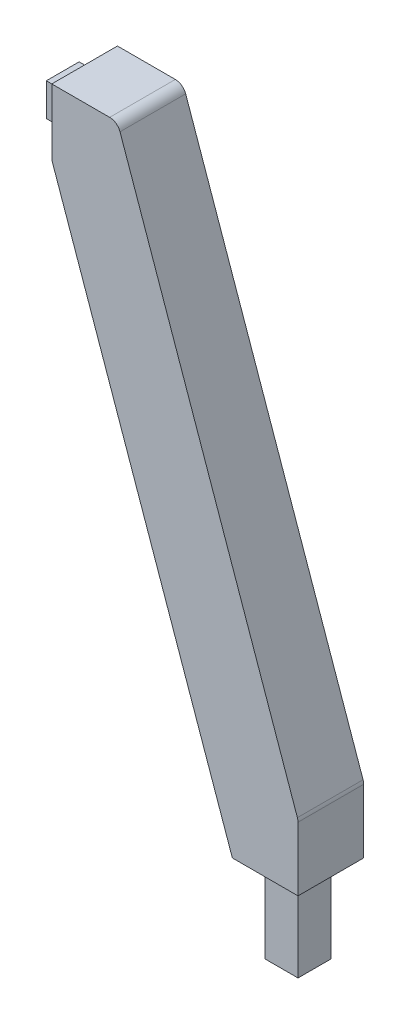
ISO-10303-21;
HEADER;
FILE_DESCRIPTION(('STEP AP214'),'2;1');
FILE_NAME('part.step','',(''),(''),'','','');
FILE_SCHEMA(('AUTOMOTIVE_DESIGN { 1 0 10303 214 1 1 1 1 }'));
ENDSEC;
DATA;
#1=APPLICATION_CONTEXT('core data for automotive mechanical design processes');
#2=APPLICATION_PROTOCOL_DEFINITION('international standard','automotive_design',2000,#1);
#3=PRODUCT_CONTEXT('',#1,'mechanical');
#4=PRODUCT('Part','Part','',(#3));
#5=PRODUCT_RELATED_PRODUCT_CATEGORY('part','',(#4));
#6=PRODUCT_DEFINITION_FORMATION('','',#4);
#7=PRODUCT_DEFINITION_CONTEXT('part definition',#1,'design');
#8=PRODUCT_DEFINITION('design','',#6,#7);
#9=PRODUCT_DEFINITION_SHAPE('','',#8);
#10=(LENGTH_UNIT() NAMED_UNIT(*) SI_UNIT(.MILLI.,.METRE.));
#11=(NAMED_UNIT(*) PLANE_ANGLE_UNIT() SI_UNIT($,.RADIAN.));
#12=(NAMED_UNIT(*) SI_UNIT($,.STERADIAN.) SOLID_ANGLE_UNIT());
#13=UNCERTAINTY_MEASURE_WITH_UNIT(LENGTH_MEASURE(1.E-05),#10,'distance_accuracy_value','');
#14=(GEOMETRIC_REPRESENTATION_CONTEXT(3) GLOBAL_UNCERTAINTY_ASSIGNED_CONTEXT((#13)) GLOBAL_UNIT_ASSIGNED_CONTEXT((#10,
#11,#12)) REPRESENTATION_CONTEXT('',''));
#15=CARTESIAN_POINT('',(0.,0.,0.));
#16=DIRECTION('',(0.,0.,1.));
#17=DIRECTION('',(1.,0.,0.));
#18=AXIS2_PLACEMENT_3D('',#15,#16,#17);
#19=CARTESIAN_POINT('',(0.,0.,30.));
#20=DIRECTION('',(0.,1.,0.));
#21=DIRECTION('',(-1.,0.,0.));
#22=AXIS2_PLACEMENT_3D('',#19,#20,#21);
#23=PLANE('',#22);
#24=DIRECTION('',(1.,0.,0.));
#25=VECTOR('',#24,1.);
#26=CARTESIAN_POINT('',(0.,0.,0.));
#27=LINE('',#26,#25);
#28=CARTESIAN_POINT('',(-30.,0.,0.));
#29=VERTEX_POINT('',#28);
#30=CARTESIAN_POINT('',(0.,0.,0.));
#31=VERTEX_POINT('',#30);
#32=EDGE_CURVE('E222',#29,#31,#27,.T.);
#33=ORIENTED_EDGE('',*,*,#32,.T.);
#34=DIRECTION('',(0.,0.,-1.));
#35=VECTOR('',#34,1.);
#36=CARTESIAN_POINT('',(0.,0.,30.));
#37=LINE('',#36,#35);
#38=CARTESIAN_POINT('',(0.,0.,30.));
#39=VERTEX_POINT('',#38);
#40=EDGE_CURVE('E232',#39,#31,#37,.T.);
#41=ORIENTED_EDGE('',*,*,#40,.F.);
#42=DIRECTION('',(1.,0.,0.));
#43=VECTOR('',#42,1.);
#44=CARTESIAN_POINT('',(0.,0.,30.));
#45=LINE('',#44,#43);
#46=CARTESIAN_POINT('',(-30.,0.,30.));
#47=VERTEX_POINT('',#46);
#48=EDGE_CURVE('E230',#47,#39,#45,.T.);
#49=ORIENTED_EDGE('',*,*,#48,.F.);
#50=DIRECTION('',(0.,0.,-1.));
#51=VECTOR('',#50,1.);
#52=CARTESIAN_POINT('',(-30.,0.,30.));
#53=LINE('',#52,#51);
#54=EDGE_CURVE('E246',#47,#29,#53,.T.);
#55=ORIENTED_EDGE('',*,*,#54,.T.);
#56=EDGE_LOOP('',(#33,#41,#49,#55));
#57=FACE_BOUND('',#56,.T.);
#58=DIRECTION('',(0.,0.,-1.));
#59=VECTOR('',#58,1.);
#60=CARTESIAN_POINT('',(-22.49,0.,22.49));
#61=LINE('',#60,#59);
#62=CARTESIAN_POINT('',(-22.49,0.,22.49));
#63=VERTEX_POINT('',#62);
#64=CARTESIAN_POINT('',(-22.49,0.,7.51));
#65=VERTEX_POINT('',#64);
#66=EDGE_CURVE('E179',#63,#65,#61,.T.);
#67=ORIENTED_EDGE('',*,*,#66,.F.);
#68=DIRECTION('',(-1.,0.,0.));
#69=VECTOR('',#68,1.);
#70=CARTESIAN_POINT('',(-22.49,0.,22.49));
#71=LINE('',#70,#69);
#72=CARTESIAN_POINT('',(-7.51,0.,22.49));
#73=VERTEX_POINT('',#72);
#74=EDGE_CURVE('E176',#73,#63,#71,.T.);
#75=ORIENTED_EDGE('',*,*,#74,.F.);
#76=DIRECTION('',(0.,0.,1.));
#77=VECTOR('',#76,1.);
#78=CARTESIAN_POINT('',(-7.51,0.,22.49));
#79=LINE('',#78,#77);
#80=CARTESIAN_POINT('',(-7.51,0.,7.51));
#81=VERTEX_POINT('',#80);
#82=EDGE_CURVE('E478',#81,#73,#79,.T.);
#83=ORIENTED_EDGE('',*,*,#82,.F.);
#84=DIRECTION('',(1.,0.,0.));
#85=VECTOR('',#84,1.);
#86=CARTESIAN_POINT('',(-22.49,0.,7.51));
#87=LINE('',#86,#85);
#88=EDGE_CURVE('E484',#65,#81,#87,.T.);
#89=ORIENTED_EDGE('',*,*,#88,.F.);
#90=EDGE_LOOP('',(#67,#75,#83,#89));
#91=FACE_BOUND('',#90,.T.);
#92=ADVANCED_FACE('F39',(#57,#91),#23,.F.);
#93=CARTESIAN_POINT('',(-112.5,235.,30.));
#94=DIRECTION('',(1.,0.,0.));
#95=DIRECTION('',(0.,0.,-1.));
#96=AXIS2_PLACEMENT_3D('',#93,#94,#95);
#97=PLANE('',#96);
#98=DIRECTION('',(0.,-1.,0.));
#99=VECTOR('',#98,1.);
#100=CARTESIAN_POINT('',(-112.5,235.,0.));
#101=LINE('',#100,#99);
#102=CARTESIAN_POINT('',(-112.5,265.,0.));
#103=VERTEX_POINT('',#102);
#104=CARTESIAN_POINT('',(-112.5,235.,0.));
#105=VERTEX_POINT('',#104);
#106=EDGE_CURVE('E239',#103,#105,#101,.T.);
#107=ORIENTED_EDGE('',*,*,#106,.T.);
#108=DIRECTION('',(0.,0.,-1.));
#109=VECTOR('',#108,1.);
#110=CARTESIAN_POINT('',(-112.5,235.,30.));
#111=LINE('',#110,#109);
#112=CARTESIAN_POINT('',(-112.5,235.,30.));
#113=VERTEX_POINT('',#112);
#114=EDGE_CURVE('E249',#113,#105,#111,.T.);
#115=ORIENTED_EDGE('',*,*,#114,.F.);
#116=DIRECTION('',(0.,-1.,0.));
#117=VECTOR('',#116,1.);
#118=CARTESIAN_POINT('',(-112.5,235.,30.));
#119=LINE('',#118,#117);
#120=CARTESIAN_POINT('',(-112.5,265.,30.));
#121=VERTEX_POINT('',#120);
#122=EDGE_CURVE('E226',#121,#113,#119,.T.);
#123=ORIENTED_EDGE('',*,*,#122,.F.);
#124=DIRECTION('',(0.,0.,-1.));
#125=VECTOR('',#124,1.);
#126=CARTESIAN_POINT('',(-112.5,265.,30.));
#127=LINE('',#126,#125);
#128=EDGE_CURVE('E252',#121,#103,#127,.T.);
#129=ORIENTED_EDGE('',*,*,#128,.T.);
#130=EDGE_LOOP('',(#107,#115,#123,#129));
#131=FACE_BOUND('',#130,.T.);
#132=DIRECTION('',(0.,-1.,0.));
#133=VECTOR('',#132,1.);
#134=CARTESIAN_POINT('',(-112.5,257.49,7.51));
#135=LINE('',#134,#133);
#136=CARTESIAN_POINT('',(-112.5,257.49,7.51));
#137=VERTEX_POINT('',#136);
#138=CARTESIAN_POINT('',(-112.5,242.51,7.51));
#139=VERTEX_POINT('',#138);
#140=EDGE_CURVE('E180',#137,#139,#135,.T.);
#141=ORIENTED_EDGE('',*,*,#140,.F.);
#142=DIRECTION('',(0.,0.,-1.));
#143=VECTOR('',#142,1.);
#144=CARTESIAN_POINT('',(-112.5,257.49,7.51));
#145=LINE('',#144,#143);
#146=CARTESIAN_POINT('',(-112.5,257.49,22.49));
#147=VERTEX_POINT('',#146);
#148=EDGE_CURVE('E193',#147,#137,#145,.T.);
#149=ORIENTED_EDGE('',*,*,#148,.F.);
#150=DIRECTION('',(0.,1.,0.));
#151=VECTOR('',#150,1.);
#152=CARTESIAN_POINT('',(-112.5,257.49,22.49));
#153=LINE('',#152,#151);
#154=CARTESIAN_POINT('',(-112.5,242.51,22.49));
#155=VERTEX_POINT('',#154);
#156=EDGE_CURVE('E202',#155,#147,#153,.T.);
#157=ORIENTED_EDGE('',*,*,#156,.F.);
#158=DIRECTION('',(0.,0.,1.));
#159=VECTOR('',#158,1.);
#160=CARTESIAN_POINT('',(-112.5,242.51,7.51));
#161=LINE('',#160,#159);
#162=EDGE_CURVE('E183',#139,#155,#161,.T.);
#163=ORIENTED_EDGE('',*,*,#162,.F.);
#164=EDGE_LOOP('',(#141,#149,#157,#163));
#165=FACE_BOUND('',#164,.T.);
#166=ADVANCED_FACE('F294',(#131,#165),#97,.F.);
#167=CARTESIAN_POINT('',(0.,0.,30.));
#168=DIRECTION('',(-1.,0.,0.));
#169=DIRECTION('',(0.,0.,1.));
#170=AXIS2_PLACEMENT_3D('',#167,#168,#169);
#171=PLANE('',#170);
#172=DIRECTION('',(0.,1.,0.));
#173=VECTOR('',#172,1.);
#174=CARTESIAN_POINT('',(0.,0.,0.));
#175=LINE('',#174,#173);
#176=CARTESIAN_POINT('',(0.,29.1478342082036,0.));
#177=VERTEX_POINT('',#176);
#178=EDGE_CURVE('E218',#31,#177,#175,.T.);
#179=ORIENTED_EDGE('',*,*,#178,.T.);
#180=DIRECTION('',(0.,0.,-1.));
#181=VECTOR('',#180,1.);
#182=CARTESIAN_POINT('',(0.,29.1478342082036,30.));
#183=LINE('',#182,#181);
#184=CARTESIAN_POINT('',(0.,29.1478342082036,30.));
#185=VERTEX_POINT('',#184);
#186=EDGE_CURVE('E62',#177,#185,#183,.F.);
#187=ORIENTED_EDGE('',*,*,#186,.T.);
#188=DIRECTION('',(0.,1.,0.));
#189=VECTOR('',#188,1.);
#190=CARTESIAN_POINT('',(0.,0.,30.));
#191=LINE('',#190,#189);
#192=EDGE_CURVE('E219',#39,#185,#191,.T.);
#193=ORIENTED_EDGE('',*,*,#192,.F.);
#194=ORIENTED_EDGE('',*,*,#40,.T.);
#195=EDGE_LOOP('',(#179,#187,#193,#194));
#196=FACE_BOUND('',#195,.T.);
#197=ADVANCED_FACE('F279',(#196),#171,.F.);
#198=CARTESIAN_POINT('',(0.,30.,30.));
#199=DIRECTION('',(-0.943544952869572,-0.331244504730807,0.));
#200=DIRECTION('',(0.331244504730807,-0.943544952869572,0.));
#201=AXIS2_PLACEMENT_3D('',#198,#199,#200);
#202=PLANE('',#201);
#203=DIRECTION('',(-0.331244504730807,0.943544952869572,0.));
#204=VECTOR('',#203,1.);
#205=CARTESIAN_POINT('',(0.,30.,30.));
#206=LINE('',#205,#204);
#207=CARTESIAN_POINT('',(-0.282275235652141,30.8040567318576,30.));
#208=VERTEX_POINT('',#207);
#209=CARTESIAN_POINT('',(-81.3261206731977,261.656222523654,30.));
#210=VERTEX_POINT('',#209);
#211=EDGE_CURVE('E221',#208,#210,#206,.T.);
#212=ORIENTED_EDGE('',*,*,#211,.F.);
#213=DIRECTION('',(0.,0.,-1.));
#214=VECTOR('',#213,1.);
#215=CARTESIAN_POINT('',(-0.282275235652141,30.8040567318576,30.));
#216=LINE('',#215,#214);
#217=CARTESIAN_POINT('',(-0.282275235652141,30.8040567318576,0.));
#218=VERTEX_POINT('',#217);
#219=EDGE_CURVE('E257',#208,#218,#216,.T.);
#220=ORIENTED_EDGE('',*,*,#219,.T.);
#221=DIRECTION('',(-0.331244504730807,0.943544952869572,0.));
#222=VECTOR('',#221,1.);
#223=CARTESIAN_POINT('',(0.,30.,0.));
#224=LINE('',#223,#222);
#225=CARTESIAN_POINT('',(-81.3261206731977,261.656222523654,0.));
#226=VERTEX_POINT('',#225);
#227=EDGE_CURVE('E234',#218,#226,#224,.T.);
#228=ORIENTED_EDGE('',*,*,#227,.T.);
#229=DIRECTION('',(0.,0.,-1.));
#230=VECTOR('',#229,1.);
#231=CARTESIAN_POINT('',(-81.3261206731977,261.656222523654,30.));
#232=LINE('',#231,#230);
#233=EDGE_CURVE('E255',#226,#210,#232,.F.);
#234=ORIENTED_EDGE('',*,*,#233,.T.);
#235=EDGE_LOOP('',(#212,#220,#228,#234));
#236=FACE_BOUND('',#235,.T.);
#237=ADVANCED_FACE('F271',(#236),#202,.F.);
#238=CARTESIAN_POINT('',(-112.5,265.,30.));
#239=DIRECTION('',(0.,-1.,0.));
#240=DIRECTION('',(0.,0.,-1.));
#241=AXIS2_PLACEMENT_3D('',#238,#239,#240);
#242=PLANE('',#241);
#243=DIRECTION('',(-1.,0.,0.));
#244=VECTOR('',#243,1.);
#245=CARTESIAN_POINT('',(-112.5,265.,30.));
#246=LINE('',#245,#244);
#247=CARTESIAN_POINT('',(-86.0438454375455,265.,30.));
#248=VERTEX_POINT('',#247);
#249=EDGE_CURVE('E224',#248,#121,#246,.T.);
#250=ORIENTED_EDGE('',*,*,#249,.F.);
#251=DIRECTION('',(0.,0.,-1.));
#252=VECTOR('',#251,1.);
#253=CARTESIAN_POINT('',(-86.0438454375455,265.,30.));
#254=LINE('',#253,#252);
#255=CARTESIAN_POINT('',(-86.0438454375455,265.,0.));
#256=VERTEX_POINT('',#255);
#257=EDGE_CURVE('E11',#248,#256,#254,.T.);
#258=ORIENTED_EDGE('',*,*,#257,.T.);
#259=DIRECTION('',(-1.,0.,0.));
#260=VECTOR('',#259,1.);
#261=CARTESIAN_POINT('',(-112.5,265.,0.));
#262=LINE('',#261,#260);
#263=EDGE_CURVE('E237',#256,#103,#262,.T.);
#264=ORIENTED_EDGE('',*,*,#263,.T.);
#265=ORIENTED_EDGE('',*,*,#128,.F.);
#266=EDGE_LOOP('',(#250,#258,#264,#265));
#267=FACE_BOUND('',#266,.T.);
#268=ADVANCED_FACE('F298',(#267),#242,.F.);
#269=CARTESIAN_POINT('',(-112.5,235.,30.));
#270=DIRECTION('',(0.943544952869572,0.331244504730807,0.));
#271=DIRECTION('',(-0.331244504730807,0.943544952869572,0.));
#272=AXIS2_PLACEMENT_3D('',#269,#270,#271);
#273=PLANE('',#272);
#274=DIRECTION('',(0.331244504730807,-0.943544952869572,0.));
#275=VECTOR('',#274,1.);
#276=CARTESIAN_POINT('',(-112.5,235.,0.));
#277=LINE('',#276,#275);
#278=EDGE_CURVE('E241',#105,#29,#277,.T.);
#279=ORIENTED_EDGE('',*,*,#278,.T.);
#280=ORIENTED_EDGE('',*,*,#54,.F.);
#281=DIRECTION('',(0.331244504730807,-0.943544952869572,0.));
#282=VECTOR('',#281,1.);
#283=CARTESIAN_POINT('',(-112.5,235.,30.));
#284=LINE('',#283,#282);
#285=EDGE_CURVE('E228',#113,#47,#284,.T.);
#286=ORIENTED_EDGE('',*,*,#285,.F.);
#287=ORIENTED_EDGE('',*,*,#114,.T.);
#288=EDGE_LOOP('',(#279,#280,#286,#287));
#289=FACE_BOUND('',#288,.T.);
#290=ADVANCED_FACE('F289',(#289),#273,.F.);
#291=CARTESIAN_POINT('',(0.,0.,30.));
#292=DIRECTION('',(0.,0.,-1.));
#293=DIRECTION('',(-1.,0.,0.));
#294=AXIS2_PLACEMENT_3D('',#291,#292,#293);
#295=PLANE('',#294);
#296=ORIENTED_EDGE('',*,*,#192,.T.);
#297=CARTESIAN_POINT('',(-5.,29.1478342082036,30.));
#298=DIRECTION('',(0.,0.,-1.));
#299=DIRECTION('',(-1.,0.,0.));
#300=AXIS2_PLACEMENT_3D('',#297,#298,#299);
#301=CIRCLE('',#300,5.);
#302=EDGE_CURVE('E47',#185,#208,#301,.F.);
#303=ORIENTED_EDGE('',*,*,#302,.T.);
#304=ORIENTED_EDGE('',*,*,#211,.T.);
#305=CARTESIAN_POINT('',(-86.0438454375455,260.,30.));
#306=DIRECTION('',(0.,0.,-1.));
#307=DIRECTION('',(-1.,0.,0.));
#308=AXIS2_PLACEMENT_3D('',#305,#306,#307);
#309=CIRCLE('',#308,5.);
#310=EDGE_CURVE('E54',#210,#248,#309,.F.);
#311=ORIENTED_EDGE('',*,*,#310,.T.);
#312=ORIENTED_EDGE('',*,*,#249,.T.);
#313=ORIENTED_EDGE('',*,*,#122,.T.);
#314=ORIENTED_EDGE('',*,*,#285,.T.);
#315=ORIENTED_EDGE('',*,*,#48,.T.);
#316=EDGE_LOOP('',(#296,#303,#304,#311,#312,#313,#314,#315));
#317=FACE_BOUND('',#316,.T.);
#318=ADVANCED_FACE('F267',(#317),#295,.F.);
#319=CARTESIAN_POINT('',(0.,0.,0.));
#320=DIRECTION('',(0.,0.,-1.));
#321=DIRECTION('',(-1.,0.,0.));
#322=AXIS2_PLACEMENT_3D('',#319,#320,#321);
#323=PLANE('',#322);
#324=ORIENTED_EDGE('',*,*,#227,.F.);
#325=CARTESIAN_POINT('',(-5.,29.1478342082036,0.));
#326=DIRECTION('',(0.,0.,-1.));
#327=DIRECTION('',(-1.,0.,0.));
#328=AXIS2_PLACEMENT_3D('',#325,#326,#327);
#329=CIRCLE('',#328,5.);
#330=EDGE_CURVE('E262',#218,#177,#329,.T.);
#331=ORIENTED_EDGE('',*,*,#330,.T.);
#332=ORIENTED_EDGE('',*,*,#178,.F.);
#333=ORIENTED_EDGE('',*,*,#32,.F.);
#334=ORIENTED_EDGE('',*,*,#278,.F.);
#335=ORIENTED_EDGE('',*,*,#106,.F.);
#336=ORIENTED_EDGE('',*,*,#263,.F.);
#337=CARTESIAN_POINT('',(-86.0438454375455,260.,0.));
#338=DIRECTION('',(0.,0.,-1.));
#339=DIRECTION('',(-1.,0.,0.));
#340=AXIS2_PLACEMENT_3D('',#337,#338,#339);
#341=CIRCLE('',#340,5.);
#342=EDGE_CURVE('E260',#256,#226,#341,.T.);
#343=ORIENTED_EDGE('',*,*,#342,.T.);
#344=EDGE_LOOP('',(#324,#331,#332,#333,#334,#335,#336,#343));
#345=FACE_BOUND('',#344,.T.);
#346=ADVANCED_FACE('F277',(#345),#323,.T.);
#347=CARTESIAN_POINT('',(-122.5,257.49,7.51));
#348=DIRECTION('',(0.,0.,1.));
#349=DIRECTION('',(0.,-1.,0.));
#350=AXIS2_PLACEMENT_3D('',#347,#348,#349);
#351=PLANE('',#350);
#352=ORIENTED_EDGE('',*,*,#140,.T.);
#353=DIRECTION('',(1.,0.,0.));
#354=VECTOR('',#353,1.);
#355=CARTESIAN_POINT('',(-122.5,242.51,7.51));
#356=LINE('',#355,#354);
#357=CARTESIAN_POINT('',(-122.5,242.51,7.51));
#358=VERTEX_POINT('',#357);
#359=EDGE_CURVE('E215',#358,#139,#356,.T.);
#360=ORIENTED_EDGE('',*,*,#359,.F.);
#361=DIRECTION('',(0.,-1.,0.));
#362=VECTOR('',#361,1.);
#363=CARTESIAN_POINT('',(-122.5,257.49,7.51));
#364=LINE('',#363,#362);
#365=CARTESIAN_POINT('',(-122.5,257.49,7.51));
#366=VERTEX_POINT('',#365);
#367=EDGE_CURVE('E189',#366,#358,#364,.T.);
#368=ORIENTED_EDGE('',*,*,#367,.F.);
#369=DIRECTION('',(1.,0.,0.));
#370=VECTOR('',#369,1.);
#371=CARTESIAN_POINT('',(-122.5,257.49,7.51));
#372=LINE('',#371,#370);
#373=EDGE_CURVE('E198',#366,#137,#372,.T.);
#374=ORIENTED_EDGE('',*,*,#373,.T.);
#375=EDGE_LOOP('',(#352,#360,#368,#374));
#376=FACE_BOUND('',#375,.T.);
#377=ADVANCED_FACE('F349',(#376),#351,.F.);
#378=CARTESIAN_POINT('',(-122.5,242.51,7.51));
#379=DIRECTION('',(0.,1.,0.));
#380=DIRECTION('',(0.,0.,1.));
#381=AXIS2_PLACEMENT_3D('',#378,#379,#380);
#382=PLANE('',#381);
#383=ORIENTED_EDGE('',*,*,#162,.T.);
#384=DIRECTION('',(1.,0.,0.));
#385=VECTOR('',#384,1.);
#386=CARTESIAN_POINT('',(-122.5,242.51,22.49));
#387=LINE('',#386,#385);
#388=CARTESIAN_POINT('',(-122.5,242.51,22.49));
#389=VERTEX_POINT('',#388);
#390=EDGE_CURVE('E212',#389,#155,#387,.T.);
#391=ORIENTED_EDGE('',*,*,#390,.F.);
#392=DIRECTION('',(0.,0.,1.));
#393=VECTOR('',#392,1.);
#394=CARTESIAN_POINT('',(-122.5,242.51,7.51));
#395=LINE('',#394,#393);
#396=EDGE_CURVE('E192',#358,#389,#395,.T.);
#397=ORIENTED_EDGE('',*,*,#396,.F.);
#398=ORIENTED_EDGE('',*,*,#359,.T.);
#399=EDGE_LOOP('',(#383,#391,#397,#398));
#400=FACE_BOUND('',#399,.T.);
#401=ADVANCED_FACE('F356',(#400),#382,.F.);
#402=CARTESIAN_POINT('',(-122.5,257.49,22.49));
#403=DIRECTION('',(0.,0.,-1.));
#404=DIRECTION('',(0.,1.,0.));
#405=AXIS2_PLACEMENT_3D('',#402,#403,#404);
#406=PLANE('',#405);
#407=ORIENTED_EDGE('',*,*,#156,.T.);
#408=DIRECTION('',(1.,0.,0.));
#409=VECTOR('',#408,1.);
#410=CARTESIAN_POINT('',(-122.5,257.49,22.49));
#411=LINE('',#410,#409);
#412=CARTESIAN_POINT('',(-122.5,257.49,22.49));
#413=VERTEX_POINT('',#412);
#414=EDGE_CURVE('E209',#413,#147,#411,.T.);
#415=ORIENTED_EDGE('',*,*,#414,.F.);
#416=DIRECTION('',(0.,1.,0.));
#417=VECTOR('',#416,1.);
#418=CARTESIAN_POINT('',(-122.5,257.49,22.49));
#419=LINE('',#418,#417);
#420=EDGE_CURVE('E195',#389,#413,#419,.T.);
#421=ORIENTED_EDGE('',*,*,#420,.F.);
#422=ORIENTED_EDGE('',*,*,#390,.T.);
#423=EDGE_LOOP('',(#407,#415,#421,#422));
#424=FACE_BOUND('',#423,.T.);
#425=ADVANCED_FACE('F364',(#424),#406,.F.);
#426=CARTESIAN_POINT('',(-122.5,257.49,7.51));
#427=DIRECTION('',(0.,-1.,0.));
#428=DIRECTION('',(0.,0.,-1.));
#429=AXIS2_PLACEMENT_3D('',#426,#427,#428);
#430=PLANE('',#429);
#431=ORIENTED_EDGE('',*,*,#148,.T.);
#432=ORIENTED_EDGE('',*,*,#373,.F.);
#433=DIRECTION('',(0.,0.,-1.));
#434=VECTOR('',#433,1.);
#435=CARTESIAN_POINT('',(-122.5,257.49,7.51));
#436=LINE('',#435,#434);
#437=EDGE_CURVE('E197',#413,#366,#436,.T.);
#438=ORIENTED_EDGE('',*,*,#437,.F.);
#439=ORIENTED_EDGE('',*,*,#414,.T.);
#440=EDGE_LOOP('',(#431,#432,#438,#439));
#441=FACE_BOUND('',#440,.T.);
#442=ADVANCED_FACE('F372',(#441),#430,.F.);
#443=CARTESIAN_POINT('',(-122.5,0.,0.));
#444=DIRECTION('',(-1.,0.,0.));
#445=DIRECTION('',(0.,0.,1.));
#446=AXIS2_PLACEMENT_3D('',#443,#444,#445);
#447=PLANE('',#446);
#448=ORIENTED_EDGE('',*,*,#367,.T.);
#449=ORIENTED_EDGE('',*,*,#396,.T.);
#450=ORIENTED_EDGE('',*,*,#420,.T.);
#451=ORIENTED_EDGE('',*,*,#437,.T.);
#452=EDGE_LOOP('',(#448,#449,#450,#451));
#453=FACE_BOUND('',#452,.T.);
#454=ADVANCED_FACE('F380',(#453),#447,.T.);
#455=CARTESIAN_POINT('',(-22.49,-40.,22.49));
#456=DIRECTION('',(1.,0.,0.));
#457=DIRECTION('',(0.,0.,-1.));
#458=AXIS2_PLACEMENT_3D('',#455,#456,#457);
#459=PLANE('',#458);
#460=ORIENTED_EDGE('',*,*,#66,.T.);
#461=DIRECTION('',(0.,1.,0.));
#462=VECTOR('',#461,1.);
#463=CARTESIAN_POINT('',(-22.49,-40.,7.51));
#464=LINE('',#463,#462);
#465=CARTESIAN_POINT('',(-22.49,-40.,7.51));
#466=VERTEX_POINT('',#465);
#467=EDGE_CURVE('E160',#466,#65,#464,.T.);
#468=ORIENTED_EDGE('',*,*,#467,.F.);
#469=DIRECTION('',(0.,0.,-1.));
#470=VECTOR('',#469,1.);
#471=CARTESIAN_POINT('',(-22.49,-40.,22.49));
#472=LINE('',#471,#470);
#473=CARTESIAN_POINT('',(-22.49,-40.,22.49));
#474=VERTEX_POINT('',#473);
#475=EDGE_CURVE('E167',#474,#466,#472,.T.);
#476=ORIENTED_EDGE('',*,*,#475,.F.);
#477=DIRECTION('',(0.,1.,0.));
#478=VECTOR('',#477,1.);
#479=CARTESIAN_POINT('',(-22.49,-40.,22.49));
#480=LINE('',#479,#478);
#481=EDGE_CURVE('E475',#474,#63,#480,.T.);
#482=ORIENTED_EDGE('',*,*,#481,.T.);
#483=EDGE_LOOP('',(#460,#468,#476,#482));
#484=FACE_BOUND('',#483,.T.);
#485=ADVANCED_FACE('F178',(#484),#459,.F.);
#486=CARTESIAN_POINT('',(-22.49,-40.,7.51));
#487=DIRECTION('',(0.,0.,1.));
#488=DIRECTION('',(1.,0.,0.));
#489=AXIS2_PLACEMENT_3D('',#486,#487,#488);
#490=PLANE('',#489);
#491=ORIENTED_EDGE('',*,*,#88,.T.);
#492=DIRECTION('',(0.,1.,0.));
#493=VECTOR('',#492,1.);
#494=CARTESIAN_POINT('',(-7.50999999999999,-40.,7.51));
#495=LINE('',#494,#493);
#496=CARTESIAN_POINT('',(-7.50999999999999,-40.,7.51));
#497=VERTEX_POINT('',#496);
#498=EDGE_CURVE('E163',#497,#81,#495,.T.);
#499=ORIENTED_EDGE('',*,*,#498,.F.);
#500=DIRECTION('',(1.,0.,0.));
#501=VECTOR('',#500,1.);
#502=CARTESIAN_POINT('',(-22.49,-40.,7.51));
#503=LINE('',#502,#501);
#504=EDGE_CURVE('E155',#466,#497,#503,.T.);
#505=ORIENTED_EDGE('',*,*,#504,.F.);
#506=ORIENTED_EDGE('',*,*,#467,.T.);
#507=EDGE_LOOP('',(#491,#499,#505,#506));
#508=FACE_BOUND('',#507,.T.);
#509=ADVANCED_FACE('F158',(#508),#490,.F.);
#510=CARTESIAN_POINT('',(-7.51,-40.,22.49));
#511=DIRECTION('',(-1.,0.,0.));
#512=DIRECTION('',(0.,0.,1.));
#513=AXIS2_PLACEMENT_3D('',#510,#511,#512);
#514=PLANE('',#513);
#515=ORIENTED_EDGE('',*,*,#82,.T.);
#516=DIRECTION('',(0.,1.,0.));
#517=VECTOR('',#516,1.);
#518=CARTESIAN_POINT('',(-7.51,-40.,22.49));
#519=LINE('',#518,#517);
#520=CARTESIAN_POINT('',(-7.51,-40.,22.49));
#521=VERTEX_POINT('',#520);
#522=EDGE_CURVE('E185',#521,#73,#519,.T.);
#523=ORIENTED_EDGE('',*,*,#522,.F.);
#524=DIRECTION('',(0.,0.,1.));
#525=VECTOR('',#524,1.);
#526=CARTESIAN_POINT('',(-7.51,-40.,22.49));
#527=LINE('',#526,#525);
#528=EDGE_CURVE('E166',#497,#521,#527,.T.);
#529=ORIENTED_EDGE('',*,*,#528,.F.);
#530=ORIENTED_EDGE('',*,*,#498,.T.);
#531=EDGE_LOOP('',(#515,#523,#529,#530));
#532=FACE_BOUND('',#531,.T.);
#533=ADVANCED_FACE('F401',(#532),#514,.F.);
#534=CARTESIAN_POINT('',(-22.49,-40.,22.49));
#535=DIRECTION('',(0.,0.,-1.));
#536=DIRECTION('',(-1.,0.,0.));
#537=AXIS2_PLACEMENT_3D('',#534,#535,#536);
#538=PLANE('',#537);
#539=ORIENTED_EDGE('',*,*,#74,.T.);
#540=ORIENTED_EDGE('',*,*,#481,.F.);
#541=DIRECTION('',(-1.,0.,0.));
#542=VECTOR('',#541,1.);
#543=CARTESIAN_POINT('',(-22.49,-40.,22.49));
#544=LINE('',#543,#542);
#545=EDGE_CURVE('E172',#521,#474,#544,.T.);
#546=ORIENTED_EDGE('',*,*,#545,.F.);
#547=ORIENTED_EDGE('',*,*,#522,.T.);
#548=EDGE_LOOP('',(#539,#540,#546,#547));
#549=FACE_BOUND('',#548,.T.);
#550=ADVANCED_FACE('F408',(#549),#538,.F.);
#551=CARTESIAN_POINT('',(0.,-40.,0.));
#552=DIRECTION('',(0.,-1.,0.));
#553=DIRECTION('',(1.,0.,0.));
#554=AXIS2_PLACEMENT_3D('',#551,#552,#553);
#555=PLANE('',#554);
#556=ORIENTED_EDGE('',*,*,#475,.T.);
#557=ORIENTED_EDGE('',*,*,#504,.T.);
#558=ORIENTED_EDGE('',*,*,#528,.T.);
#559=ORIENTED_EDGE('',*,*,#545,.T.);
#560=EDGE_LOOP('',(#556,#557,#558,#559));
#561=FACE_BOUND('',#560,.T.);
#562=ADVANCED_FACE('F170',(#561),#555,.T.);
#563=CARTESIAN_POINT('',(-5.,29.1478342082036,30.));
#564=DIRECTION('',(0.,0.,-1.));
#565=DIRECTION('',(-1.,0.,0.));
#566=AXIS2_PLACEMENT_3D('',#563,#564,#565);
#567=CYLINDRICAL_SURFACE('',#566,5.);
#568=ORIENTED_EDGE('',*,*,#302,.F.);
#569=ORIENTED_EDGE('',*,*,#186,.F.);
#570=ORIENTED_EDGE('',*,*,#330,.F.);
#571=ORIENTED_EDGE('',*,*,#219,.F.);
#572=EDGE_LOOP('',(#568,#569,#570,#571));
#573=FACE_BOUND('',#572,.T.);
#574=ADVANCED_FACE('F274',(#573),#567,.T.);
#575=CARTESIAN_POINT('',(-86.0438454375455,260.,30.));
#576=DIRECTION('',(0.,0.,-1.));
#577=DIRECTION('',(-1.,0.,0.));
#578=AXIS2_PLACEMENT_3D('',#575,#576,#577);
#579=CYLINDRICAL_SURFACE('',#578,5.);
#580=ORIENTED_EDGE('',*,*,#310,.F.);
#581=ORIENTED_EDGE('',*,*,#233,.F.);
#582=ORIENTED_EDGE('',*,*,#342,.F.);
#583=ORIENTED_EDGE('',*,*,#257,.F.);
#584=EDGE_LOOP('',(#580,#581,#582,#583));
#585=FACE_BOUND('',#584,.T.);
#586=ADVANCED_FACE('F41',(#585),#579,.T.);
#587=CLOSED_SHELL('',(#92,#166,#197,#237,#268,#290,#318,#346,#377,#401,#425,#442,#454,#485,#509,
#533,#550,#562,#574,#586));
#588=MANIFOLD_SOLID_BREP('B2',#587);
#589=ADVANCED_BREP_SHAPE_REPRESENTATION('',(#18,#588),#14);
#590=SHAPE_DEFINITION_REPRESENTATION(#9,#589);
ENDSEC;
END-ISO-10303-21;
